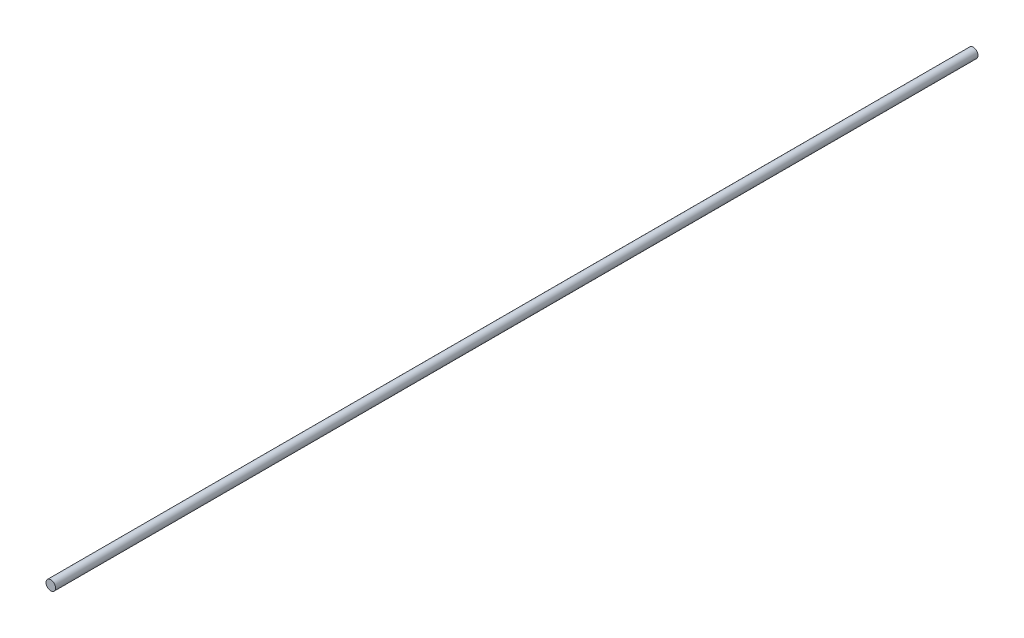
ISO-10303-21;
HEADER;
FILE_DESCRIPTION(('STEP AP214'),'2;1');
FILE_NAME('part.step','',(''),(''),'','','');
FILE_SCHEMA(('AUTOMOTIVE_DESIGN { 1 0 10303 214 1 1 1 1 }'));
ENDSEC;
DATA;
#1=APPLICATION_CONTEXT('core data for automotive mechanical design processes');
#2=APPLICATION_PROTOCOL_DEFINITION('international standard','automotive_design',2000,#1);
#3=PRODUCT_CONTEXT('',#1,'mechanical');
#4=PRODUCT('Part','Part','',(#3));
#5=PRODUCT_RELATED_PRODUCT_CATEGORY('part','',(#4));
#6=PRODUCT_DEFINITION_FORMATION('','',#4);
#7=PRODUCT_DEFINITION_CONTEXT('part definition',#1,'design');
#8=PRODUCT_DEFINITION('design','',#6,#7);
#9=PRODUCT_DEFINITION_SHAPE('','',#8);
#10=(LENGTH_UNIT() NAMED_UNIT(*) SI_UNIT(.MILLI.,.METRE.));
#11=(NAMED_UNIT(*) PLANE_ANGLE_UNIT() SI_UNIT($,.RADIAN.));
#12=(NAMED_UNIT(*) SI_UNIT($,.STERADIAN.) SOLID_ANGLE_UNIT());
#13=UNCERTAINTY_MEASURE_WITH_UNIT(LENGTH_MEASURE(1.E-05),#10,'distance_accuracy_value','');
#14=(GEOMETRIC_REPRESENTATION_CONTEXT(3) GLOBAL_UNCERTAINTY_ASSIGNED_CONTEXT((#13)) GLOBAL_UNIT_ASSIGNED_CONTEXT((#10,
#11,#12)) REPRESENTATION_CONTEXT('',''));
#15=CARTESIAN_POINT('',(0.,0.,0.));
#16=DIRECTION('',(0.,0.,1.));
#17=DIRECTION('',(1.,0.,0.));
#18=AXIS2_PLACEMENT_3D('',#15,#16,#17);
#19=CARTESIAN_POINT('',(0.,0.,914.4));
#20=DIRECTION('',(0.,0.,-1.));
#21=DIRECTION('',(-1.,0.,0.));
#22=AXIS2_PLACEMENT_3D('',#19,#20,#21);
#23=CYLINDRICAL_SURFACE('',#22,4.7625);
#24=CARTESIAN_POINT('',(0.,0.,914.4));
#25=DIRECTION('',(0.,0.,1.));
#26=DIRECTION('',(1.,0.,0.));
#27=AXIS2_PLACEMENT_3D('',#24,#25,#26);
#28=CIRCLE('',#27,4.7625);
#29=CARTESIAN_POINT('',(4.7625,0.,914.4));
#30=VERTEX_POINT('',#29);
#31=EDGE_CURVE('E10',#30,#30,#28,.T.);
#32=ORIENTED_EDGE('',*,*,#31,.F.);
#33=EDGE_LOOP('',(#32));
#34=FACE_BOUND('',#33,.T.);
#35=CARTESIAN_POINT('',(0.,0.,0.));
#36=DIRECTION('',(0.,0.,1.));
#37=DIRECTION('',(1.,0.,0.));
#38=AXIS2_PLACEMENT_3D('',#35,#36,#37);
#39=CIRCLE('',#38,4.7625);
#40=CARTESIAN_POINT('',(4.7625,0.,0.));
#41=VERTEX_POINT('',#40);
#42=EDGE_CURVE('E36',#41,#41,#39,.T.);
#43=ORIENTED_EDGE('',*,*,#42,.T.);
#44=EDGE_LOOP('',(#43));
#45=FACE_BOUND('',#44,.T.);
#46=ADVANCED_FACE('F33',(#34,#45),#23,.T.);
#47=CARTESIAN_POINT('',(0.,0.,914.4));
#48=DIRECTION('',(0.,0.,1.));
#49=DIRECTION('',(1.,0.,0.));
#50=AXIS2_PLACEMENT_3D('',#47,#48,#49);
#51=PLANE('',#50);
#52=ORIENTED_EDGE('',*,*,#31,.T.);
#53=EDGE_LOOP('',(#52));
#54=FACE_BOUND('',#53,.T.);
#55=ADVANCED_FACE('F48',(#54),#51,.T.);
#56=CARTESIAN_POINT('',(0.,0.,0.));
#57=DIRECTION('',(0.,0.,1.));
#58=DIRECTION('',(1.,0.,0.));
#59=AXIS2_PLACEMENT_3D('',#56,#57,#58);
#60=PLANE('',#59);
#61=ORIENTED_EDGE('',*,*,#42,.F.);
#62=EDGE_LOOP('',(#61));
#63=FACE_BOUND('',#62,.T.);
#64=ADVANCED_FACE('F46',(#63),#60,.F.);
#65=CLOSED_SHELL('',(#46,#55,#64));
#66=MANIFOLD_SOLID_BREP('B2',#65);
#67=ADVANCED_BREP_SHAPE_REPRESENTATION('',(#18,#66),#14);
#68=SHAPE_DEFINITION_REPRESENTATION(#9,#67);
ENDSEC;
END-ISO-10303-21;
